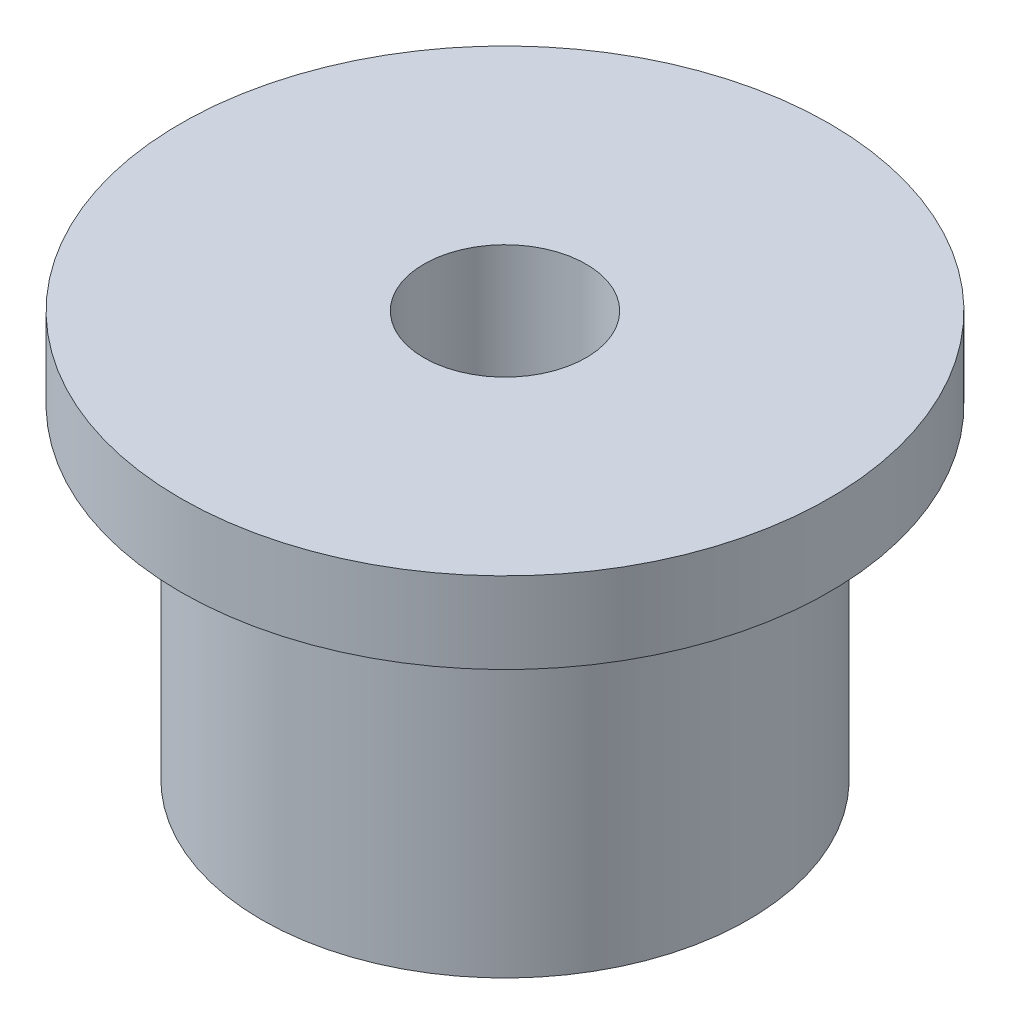
ISO-10303-21;
HEADER;
FILE_DESCRIPTION(('STEP AP214'),'2;1');
FILE_NAME('part.step','',(''),(''),'','','');
FILE_SCHEMA(('AUTOMOTIVE_DESIGN { 1 0 10303 214 1 1 1 1 }'));
ENDSEC;
DATA;
#1=APPLICATION_CONTEXT('core data for automotive mechanical design processes');
#2=APPLICATION_PROTOCOL_DEFINITION('international standard','automotive_design',2000,#1);
#3=PRODUCT_CONTEXT('',#1,'mechanical');
#4=PRODUCT('Part','Part','',(#3));
#5=PRODUCT_RELATED_PRODUCT_CATEGORY('part','',(#4));
#6=PRODUCT_DEFINITION_FORMATION('','',#4);
#7=PRODUCT_DEFINITION_CONTEXT('part definition',#1,'design');
#8=PRODUCT_DEFINITION('design','',#6,#7);
#9=PRODUCT_DEFINITION_SHAPE('','',#8);
#10=(LENGTH_UNIT() NAMED_UNIT(*) SI_UNIT(.MILLI.,.METRE.));
#11=(NAMED_UNIT(*) PLANE_ANGLE_UNIT() SI_UNIT($,.RADIAN.));
#12=(NAMED_UNIT(*) SI_UNIT($,.STERADIAN.) SOLID_ANGLE_UNIT());
#13=UNCERTAINTY_MEASURE_WITH_UNIT(LENGTH_MEASURE(1.E-05),#10,'distance_accuracy_value','');
#14=(GEOMETRIC_REPRESENTATION_CONTEXT(3) GLOBAL_UNCERTAINTY_ASSIGNED_CONTEXT((#13)) GLOBAL_UNIT_ASSIGNED_CONTEXT((#10,
#11,#12)) REPRESENTATION_CONTEXT('',''));
#15=CARTESIAN_POINT('',(0.,0.,0.));
#16=DIRECTION('',(0.,0.,1.));
#17=DIRECTION('',(1.,0.,0.));
#18=AXIS2_PLACEMENT_3D('',#15,#16,#17);
#19=CARTESIAN_POINT('',(0.,62.5,0.));
#20=DIRECTION('',(0.,1.,0.));
#21=DIRECTION('',(0.,0.,1.));
#22=AXIS2_PLACEMENT_3D('',#19,#20,#21);
#23=CYLINDRICAL_SURFACE('',#22,25.);
#24=CARTESIAN_POINT('',(0.,-62.5,0.));
#25=DIRECTION('',(0.,1.,0.));
#26=DIRECTION('',(0.,0.,1.));
#27=AXIS2_PLACEMENT_3D('',#24,#25,#26);
#28=CIRCLE('',#27,25.);
#29=CARTESIAN_POINT('',(0.,-62.5,25.));
#30=VERTEX_POINT('',#29);
#31=EDGE_CURVE('E10',#30,#30,#28,.T.);
#32=ORIENTED_EDGE('',*,*,#31,.F.);
#33=EDGE_LOOP('',(#32));
#34=FACE_BOUND('',#33,.T.);
#35=CARTESIAN_POINT('',(0.,62.5,0.));
#36=DIRECTION('',(0.,1.,0.));
#37=DIRECTION('',(0.,0.,1.));
#38=AXIS2_PLACEMENT_3D('',#35,#36,#37);
#39=CIRCLE('',#38,25.);
#40=CARTESIAN_POINT('',(0.,62.5,25.));
#41=VERTEX_POINT('',#40);
#42=EDGE_CURVE('E53',#41,#41,#39,.T.);
#43=ORIENTED_EDGE('',*,*,#42,.T.);
#44=EDGE_LOOP('',(#43));
#45=FACE_BOUND('',#44,.T.);
#46=ADVANCED_FACE('F31',(#34,#45),#23,.F.);
#47=CARTESIAN_POINT('',(25.,-62.5,0.));
#48=DIRECTION('',(0.,1.,0.));
#49=DIRECTION('',(0.,0.,1.));
#50=AXIS2_PLACEMENT_3D('',#47,#48,#49);
#51=PLANE('',#50);
#52=CARTESIAN_POINT('',(0.,-62.5,0.));
#53=DIRECTION('',(0.,1.,0.));
#54=DIRECTION('',(0.,0.,1.));
#55=AXIS2_PLACEMENT_3D('',#52,#53,#54);
#56=CIRCLE('',#55,75.);
#57=CARTESIAN_POINT('',(0.,-62.5,75.));
#58=VERTEX_POINT('',#57);
#59=EDGE_CURVE('E37',#58,#58,#56,.T.);
#60=ORIENTED_EDGE('',*,*,#59,.F.);
#61=EDGE_LOOP('',(#60));
#62=FACE_BOUND('',#61,.T.);
#63=ORIENTED_EDGE('',*,*,#31,.T.);
#64=EDGE_LOOP('',(#63));
#65=FACE_BOUND('',#64,.T.);
#66=ADVANCED_FACE('F78',(#62,#65),#51,.F.);
#67=CARTESIAN_POINT('',(0.,62.5,0.));
#68=DIRECTION('',(0.,1.,0.));
#69=DIRECTION('',(0.,0.,1.));
#70=AXIS2_PLACEMENT_3D('',#67,#68,#69);
#71=CYLINDRICAL_SURFACE('',#70,75.);
#72=CARTESIAN_POINT('',(0.,37.5,0.));
#73=DIRECTION('',(0.,1.,0.));
#74=DIRECTION('',(0.,0.,1.));
#75=AXIS2_PLACEMENT_3D('',#72,#73,#74);
#76=CIRCLE('',#75,75.);
#77=CARTESIAN_POINT('',(0.,37.5,75.));
#78=VERTEX_POINT('',#77);
#79=EDGE_CURVE('E41',#78,#78,#76,.T.);
#80=ORIENTED_EDGE('',*,*,#79,.F.);
#81=EDGE_LOOP('',(#80));
#82=FACE_BOUND('',#81,.T.);
#83=ORIENTED_EDGE('',*,*,#59,.T.);
#84=EDGE_LOOP('',(#83));
#85=FACE_BOUND('',#84,.T.);
#86=ADVANCED_FACE('F73',(#82,#85),#71,.T.);
#87=CARTESIAN_POINT('',(75.,37.5,0.));
#88=DIRECTION('',(0.,1.,0.));
#89=DIRECTION('',(0.,0.,1.));
#90=AXIS2_PLACEMENT_3D('',#87,#88,#89);
#91=PLANE('',#90);
#92=CARTESIAN_POINT('',(0.,37.5,0.));
#93=DIRECTION('',(0.,1.,0.));
#94=DIRECTION('',(0.,0.,1.));
#95=AXIS2_PLACEMENT_3D('',#92,#93,#94);
#96=CIRCLE('',#95,100.);
#97=CARTESIAN_POINT('',(0.,37.5,100.));
#98=VERTEX_POINT('',#97);
#99=EDGE_CURVE('E45',#98,#98,#96,.T.);
#100=ORIENTED_EDGE('',*,*,#99,.F.);
#101=EDGE_LOOP('',(#100));
#102=FACE_BOUND('',#101,.T.);
#103=ORIENTED_EDGE('',*,*,#79,.T.);
#104=EDGE_LOOP('',(#103));
#105=FACE_BOUND('',#104,.T.);
#106=ADVANCED_FACE('F67',(#102,#105),#91,.F.);
#107=CARTESIAN_POINT('',(0.,62.5,0.));
#108=DIRECTION('',(0.,1.,0.));
#109=DIRECTION('',(0.,0.,1.));
#110=AXIS2_PLACEMENT_3D('',#107,#108,#109);
#111=CYLINDRICAL_SURFACE('',#110,100.);
#112=CARTESIAN_POINT('',(0.,62.5,0.));
#113=DIRECTION('',(0.,1.,0.));
#114=DIRECTION('',(0.,0.,1.));
#115=AXIS2_PLACEMENT_3D('',#112,#113,#114);
#116=CIRCLE('',#115,100.);
#117=CARTESIAN_POINT('',(0.,62.5,100.));
#118=VERTEX_POINT('',#117);
#119=EDGE_CURVE('E50',#118,#118,#116,.T.);
#120=ORIENTED_EDGE('',*,*,#119,.F.);
#121=EDGE_LOOP('',(#120));
#122=FACE_BOUND('',#121,.T.);
#123=ORIENTED_EDGE('',*,*,#99,.T.);
#124=EDGE_LOOP('',(#123));
#125=FACE_BOUND('',#124,.T.);
#126=ADVANCED_FACE('F61',(#122,#125),#111,.T.);
#127=CARTESIAN_POINT('',(25.,62.5,0.));
#128=DIRECTION('',(0.,-1.,0.));
#129=DIRECTION('',(0.,0.,-1.));
#130=AXIS2_PLACEMENT_3D('',#127,#128,#129);
#131=PLANE('',#130);
#132=ORIENTED_EDGE('',*,*,#42,.F.);
#133=EDGE_LOOP('',(#132));
#134=FACE_BOUND('',#133,.T.);
#135=ORIENTED_EDGE('',*,*,#119,.T.);
#136=EDGE_LOOP('',(#135));
#137=FACE_BOUND('',#136,.T.);
#138=ADVANCED_FACE('F58',(#134,#137),#131,.F.);
#139=CLOSED_SHELL('',(#46,#66,#86,#106,#126,#138));
#140=MANIFOLD_SOLID_BREP('B2',#139);
#141=ADVANCED_BREP_SHAPE_REPRESENTATION('',(#18,#140),#14);
#142=SHAPE_DEFINITION_REPRESENTATION(#9,#141);
ENDSEC;
END-ISO-10303-21;
